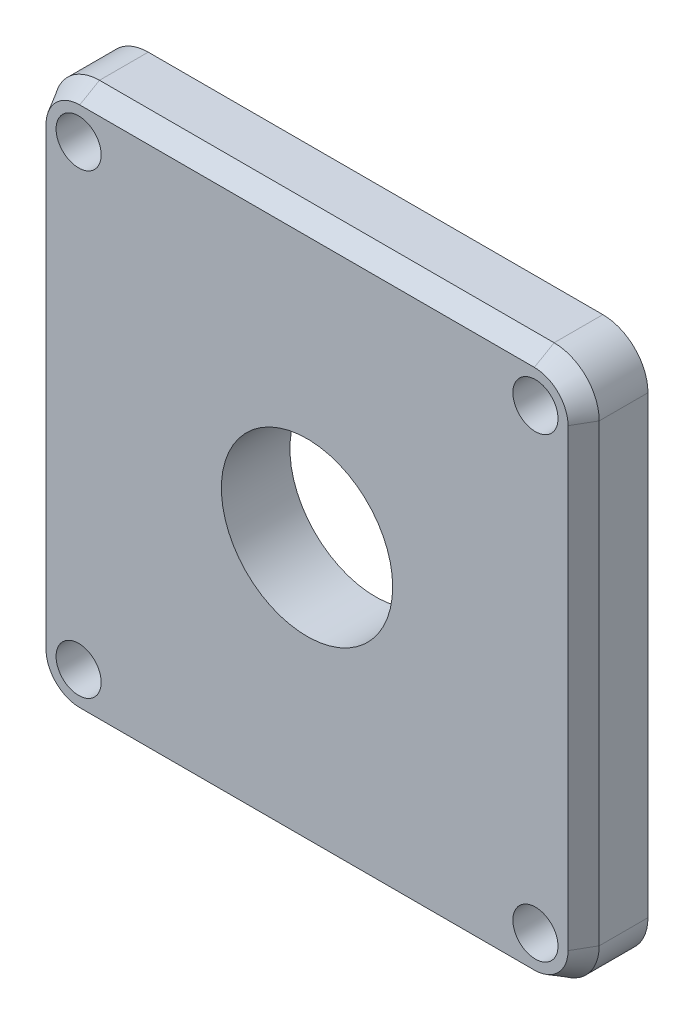
ISO-10303-21;
HEADER;
FILE_DESCRIPTION(('STEP AP214'),'2;1');
FILE_NAME('part.step','',(''),(''),'','','');
FILE_SCHEMA(('AUTOMOTIVE_DESIGN { 1 0 10303 214 1 1 1 1 }'));
ENDSEC;
DATA;
#1=APPLICATION_CONTEXT('core data for automotive mechanical design processes');
#2=APPLICATION_PROTOCOL_DEFINITION('international standard','automotive_design',2000,#1);
#3=PRODUCT_CONTEXT('',#1,'mechanical');
#4=PRODUCT('Part','Part','',(#3));
#5=PRODUCT_RELATED_PRODUCT_CATEGORY('part','',(#4));
#6=PRODUCT_DEFINITION_FORMATION('','',#4);
#7=PRODUCT_DEFINITION_CONTEXT('part definition',#1,'design');
#8=PRODUCT_DEFINITION('design','',#6,#7);
#9=PRODUCT_DEFINITION_SHAPE('','',#8);
#10=(LENGTH_UNIT() NAMED_UNIT(*) SI_UNIT(.MILLI.,.METRE.));
#11=(NAMED_UNIT(*) PLANE_ANGLE_UNIT() SI_UNIT($,.RADIAN.));
#12=(NAMED_UNIT(*) SI_UNIT($,.STERADIAN.) SOLID_ANGLE_UNIT());
#13=UNCERTAINTY_MEASURE_WITH_UNIT(LENGTH_MEASURE(1.E-05),#10,'distance_accuracy_value','');
#14=(GEOMETRIC_REPRESENTATION_CONTEXT(3) GLOBAL_UNCERTAINTY_ASSIGNED_CONTEXT((#13)) GLOBAL_UNIT_ASSIGNED_CONTEXT((#10,
#11,#12)) REPRESENTATION_CONTEXT('',''));
#15=CARTESIAN_POINT('',(0.,0.,0.));
#16=DIRECTION('',(0.,0.,1.));
#17=DIRECTION('',(1.,0.,0.));
#18=AXIS2_PLACEMENT_3D('',#15,#16,#17);
#19=CARTESIAN_POINT('',(0.,-47.7074639149334,2.));
#20=DIRECTION('',(0.,1.,0.));
#21=DIRECTION('',(0.,0.,1.));
#22=AXIS2_PLACEMENT_3D('',#19,#20,#21);
#23=PLANE('',#22);
#24=DIRECTION('',(0.,0.,-1.));
#25=VECTOR('',#24,1.);
#26=CARTESIAN_POINT('',(39.8074639149334,-47.7074639149334,2.));
#27=LINE('',#26,#25);
#28=CARTESIAN_POINT('',(39.8074639149334,-47.7074639149334,0.));
#29=VERTEX_POINT('',#28);
#30=CARTESIAN_POINT('',(39.8074639149334,-47.7074639149334,8.53589838486224));
#31=VERTEX_POINT('',#30);
#32=EDGE_CURVE('E181',#29,#31,#27,.F.);
#33=ORIENTED_EDGE('',*,*,#32,.T.);
#34=DIRECTION('',(-1.,0.,0.));
#35=VECTOR('',#34,1.);
#36=CARTESIAN_POINT('',(0.,-47.7074639149334,8.53589838486224));
#37=LINE('',#36,#35);
#38=CARTESIAN_POINT('',(-39.8074639149334,-47.7074639149334,8.53589838486224));
#39=VERTEX_POINT('',#38);
#40=EDGE_CURVE('E11',#31,#39,#37,.T.);
#41=ORIENTED_EDGE('',*,*,#40,.T.);
#42=DIRECTION('',(0.,0.,-1.));
#43=VECTOR('',#42,1.);
#44=CARTESIAN_POINT('',(-39.8074639149334,-47.7074639149334,0.));
#45=LINE('',#44,#43);
#46=CARTESIAN_POINT('',(-39.8074639149334,-47.7074639149334,0.));
#47=VERTEX_POINT('',#46);
#48=EDGE_CURVE('E179',#39,#47,#45,.T.);
#49=ORIENTED_EDGE('',*,*,#48,.T.);
#50=DIRECTION('',(1.,0.,0.));
#51=VECTOR('',#50,1.);
#52=CARTESIAN_POINT('',(0.,-47.7074639149334,0.));
#53=LINE('',#52,#51);
#54=EDGE_CURVE('E276',#47,#29,#53,.T.);
#55=ORIENTED_EDGE('',*,*,#54,.T.);
#56=EDGE_LOOP('',(#33,#41,#49,#55));
#57=FACE_BOUND('',#56,.T.);
#58=ADVANCED_FACE('F47',(#57),#23,.F.);
#59=CARTESIAN_POINT('',(47.7074639149334,0.,2.));
#60=DIRECTION('',(-1.,0.,0.));
#61=DIRECTION('',(0.,0.,1.));
#62=AXIS2_PLACEMENT_3D('',#59,#60,#61);
#63=PLANE('',#62);
#64=DIRECTION('',(0.,0.,-1.));
#65=VECTOR('',#64,1.);
#66=CARTESIAN_POINT('',(47.7074639149334,39.8074639149334,12.));
#67=LINE('',#66,#65);
#68=CARTESIAN_POINT('',(47.7074639149334,39.8074639149334,0.));
#69=VERTEX_POINT('',#68);
#70=CARTESIAN_POINT('',(47.7074639149334,39.8074639149334,8.53589838486224));
#71=VERTEX_POINT('',#70);
#72=EDGE_CURVE('E176',#69,#71,#67,.F.);
#73=ORIENTED_EDGE('',*,*,#72,.T.);
#74=DIRECTION('',(0.,-1.,0.));
#75=VECTOR('',#74,1.);
#76=CARTESIAN_POINT('',(47.7074639149334,0.,8.53589838486224));
#77=LINE('',#76,#75);
#78=CARTESIAN_POINT('',(47.7074639149334,-39.8074639149334,8.53589838486224));
#79=VERTEX_POINT('',#78);
#80=EDGE_CURVE('E210',#71,#79,#77,.T.);
#81=ORIENTED_EDGE('',*,*,#80,.T.);
#82=DIRECTION('',(0.,0.,-1.));
#83=VECTOR('',#82,1.);
#84=CARTESIAN_POINT('',(47.7074639149334,-39.8074639149334,2.));
#85=LINE('',#84,#83);
#86=CARTESIAN_POINT('',(47.7074639149334,-39.8074639149334,0.));
#87=VERTEX_POINT('',#86);
#88=EDGE_CURVE('E174',#79,#87,#85,.T.);
#89=ORIENTED_EDGE('',*,*,#88,.T.);
#90=DIRECTION('',(0.,1.,0.));
#91=VECTOR('',#90,1.);
#92=CARTESIAN_POINT('',(47.7074639149334,0.,0.));
#93=LINE('',#92,#91);
#94=EDGE_CURVE('E160',#87,#69,#93,.T.);
#95=ORIENTED_EDGE('',*,*,#94,.T.);
#96=EDGE_LOOP('',(#73,#81,#89,#95));
#97=FACE_BOUND('',#96,.T.);
#98=ADVANCED_FACE('F283',(#97),#63,.F.);
#99=CARTESIAN_POINT('',(0.,47.7074639149334,2.));
#100=DIRECTION('',(0.,1.,0.));
#101=DIRECTION('',(0.,0.,1.));
#102=AXIS2_PLACEMENT_3D('',#99,#100,#101);
#103=PLANE('',#102);
#104=DIRECTION('',(0.,0.,-1.));
#105=VECTOR('',#104,1.);
#106=CARTESIAN_POINT('',(-39.8074639149334,47.7074639149334,2.));
#107=LINE('',#106,#105);
#108=CARTESIAN_POINT('',(-39.8074639149334,47.7074639149334,0.));
#109=VERTEX_POINT('',#108);
#110=CARTESIAN_POINT('',(-39.8074639149334,47.7074639149334,8.53589838486224));
#111=VERTEX_POINT('',#110);
#112=EDGE_CURVE('E156',#109,#111,#107,.F.);
#113=ORIENTED_EDGE('',*,*,#112,.T.);
#114=DIRECTION('',(1.,0.,0.));
#115=VECTOR('',#114,1.);
#116=CARTESIAN_POINT('',(39.8074639149334,47.7074639149334,8.53589838486224));
#117=LINE('',#116,#115);
#118=CARTESIAN_POINT('',(39.8074639149334,47.7074639149334,8.53589838486224));
#119=VERTEX_POINT('',#118);
#120=EDGE_CURVE('E188',#111,#119,#117,.T.);
#121=ORIENTED_EDGE('',*,*,#120,.T.);
#122=DIRECTION('',(0.,0.,-1.));
#123=VECTOR('',#122,1.);
#124=CARTESIAN_POINT('',(39.8074639149334,47.7074639149334,0.));
#125=LINE('',#124,#123);
#126=CARTESIAN_POINT('',(39.8074639149334,47.7074639149334,0.));
#127=VERTEX_POINT('',#126);
#128=EDGE_CURVE('E150',#119,#127,#125,.T.);
#129=ORIENTED_EDGE('',*,*,#128,.T.);
#130=DIRECTION('',(1.,0.,0.));
#131=VECTOR('',#130,1.);
#132=CARTESIAN_POINT('',(0.,47.7074639149334,0.));
#133=LINE('',#132,#131);
#134=EDGE_CURVE('E143',#109,#127,#133,.T.);
#135=ORIENTED_EDGE('',*,*,#134,.F.);
#136=EDGE_LOOP('',(#113,#121,#129,#135));
#137=FACE_BOUND('',#136,.T.);
#138=ADVANCED_FACE('F154',(#137),#103,.T.);
#139=CARTESIAN_POINT('',(0.,0.,2.));
#140=DIRECTION('',(0.,0.,-1.));
#141=DIRECTION('',(-1.,0.,0.));
#142=AXIS2_PLACEMENT_3D('',#139,#140,#141);
#143=CYLINDRICAL_SURFACE('',#142,15.);
#144=CARTESIAN_POINT('',(0.,0.,0.));
#145=DIRECTION('',(0.,0.,1.));
#146=DIRECTION('',(1.,0.,0.));
#147=AXIS2_PLACEMENT_3D('',#144,#145,#146);
#148=CIRCLE('',#147,15.);
#149=CARTESIAN_POINT('',(15.,0.,0.));
#150=VERTEX_POINT('',#149);
#151=EDGE_CURVE('E273',#150,#150,#148,.T.);
#152=ORIENTED_EDGE('',*,*,#151,.F.);
#153=EDGE_LOOP('',(#152));
#154=FACE_BOUND('',#153,.T.);
#155=CARTESIAN_POINT('',(0.,0.,12.));
#156=DIRECTION('',(0.,0.,1.));
#157=DIRECTION('',(1.,0.,0.));
#158=AXIS2_PLACEMENT_3D('',#155,#156,#157);
#159=CIRCLE('',#158,15.);
#160=CARTESIAN_POINT('',(15.,0.,12.));
#161=VERTEX_POINT('',#160);
#162=EDGE_CURVE('E268',#161,#161,#159,.T.);
#163=ORIENTED_EDGE('',*,*,#162,.T.);
#164=EDGE_LOOP('',(#163));
#165=FACE_BOUND('',#164,.T.);
#166=ADVANCED_FACE('F328',(#154,#165),#143,.F.);
#167=CARTESIAN_POINT('',(-47.7074639149334,0.,2.));
#168=DIRECTION('',(-1.,0.,0.));
#169=DIRECTION('',(0.,0.,1.));
#170=AXIS2_PLACEMENT_3D('',#167,#168,#169);
#171=PLANE('',#170);
#172=DIRECTION('',(0.,0.,-1.));
#173=VECTOR('',#172,1.);
#174=CARTESIAN_POINT('',(-47.7074639149334,-39.8074639149334,12.));
#175=LINE('',#174,#173);
#176=CARTESIAN_POINT('',(-47.7074639149334,-39.8074639149334,0.));
#177=VERTEX_POINT('',#176);
#178=CARTESIAN_POINT('',(-47.7074639149334,-39.8074639149334,8.53589838486224));
#179=VERTEX_POINT('',#178);
#180=EDGE_CURVE('E185',#177,#179,#175,.F.);
#181=ORIENTED_EDGE('',*,*,#180,.T.);
#182=DIRECTION('',(0.,1.,0.));
#183=VECTOR('',#182,1.);
#184=CARTESIAN_POINT('',(-47.7074639149334,39.8074639149334,8.53589838486224));
#185=LINE('',#184,#183);
#186=CARTESIAN_POINT('',(-47.7074639149334,39.8074639149334,8.53589838486224));
#187=VERTEX_POINT('',#186);
#188=EDGE_CURVE('E212',#179,#187,#185,.T.);
#189=ORIENTED_EDGE('',*,*,#188,.T.);
#190=DIRECTION('',(0.,0.,-1.));
#191=VECTOR('',#190,1.);
#192=CARTESIAN_POINT('',(-47.7074639149334,39.8074639149334,2.));
#193=LINE('',#192,#191);
#194=CARTESIAN_POINT('',(-47.7074639149334,39.8074639149334,0.));
#195=VERTEX_POINT('',#194);
#196=EDGE_CURVE('E183',#187,#195,#193,.T.);
#197=ORIENTED_EDGE('',*,*,#196,.T.);
#198=DIRECTION('',(0.,1.,0.));
#199=VECTOR('',#198,1.);
#200=CARTESIAN_POINT('',(-47.7074639149334,0.,0.));
#201=LINE('',#200,#199);
#202=EDGE_CURVE('E145',#177,#195,#201,.T.);
#203=ORIENTED_EDGE('',*,*,#202,.F.);
#204=EDGE_LOOP('',(#181,#189,#197,#203));
#205=FACE_BOUND('',#204,.T.);
#206=ADVANCED_FACE('F331',(#205),#171,.T.);
#207=CARTESIAN_POINT('',(0.,0.,0.));
#208=DIRECTION('',(0.,0.,1.));
#209=DIRECTION('',(1.,0.,0.));
#210=AXIS2_PLACEMENT_3D('',#207,#208,#209);
#211=PLANE('',#210);
#212=CARTESIAN_POINT('',(-30.,30.,0.));
#213=DIRECTION('',(0.,0.,-1.));
#214=DIRECTION('',(-1.,0.,0.));
#215=AXIS2_PLACEMENT_3D('',#212,#213,#214);
#216=CIRCLE('',#215,3.15);
#217=CARTESIAN_POINT('',(-33.15,30.,0.));
#218=VERTEX_POINT('',#217);
#219=EDGE_CURVE('E739',#218,#218,#216,.T.);
#220=ORIENTED_EDGE('',*,*,#219,.F.);
#221=EDGE_LOOP('',(#220));
#222=FACE_BOUND('',#221,.T.);
#223=CARTESIAN_POINT('',(-30.,-30.,0.));
#224=DIRECTION('',(0.,0.,-1.));
#225=DIRECTION('',(-1.,0.,0.));
#226=AXIS2_PLACEMENT_3D('',#223,#224,#225);
#227=CIRCLE('',#226,3.15);
#228=CARTESIAN_POINT('',(-33.15,-30.,0.));
#229=VERTEX_POINT('',#228);
#230=EDGE_CURVE('E743',#229,#229,#227,.T.);
#231=ORIENTED_EDGE('',*,*,#230,.F.);
#232=EDGE_LOOP('',(#231));
#233=FACE_BOUND('',#232,.T.);
#234=CARTESIAN_POINT('',(30.,-30.,0.));
#235=DIRECTION('',(0.,0.,-1.));
#236=DIRECTION('',(-1.,0.,0.));
#237=AXIS2_PLACEMENT_3D('',#234,#235,#236);
#238=CIRCLE('',#237,3.15);
#239=CARTESIAN_POINT('',(26.85,-30.,0.));
#240=VERTEX_POINT('',#239);
#241=EDGE_CURVE('E747',#240,#240,#238,.T.);
#242=ORIENTED_EDGE('',*,*,#241,.F.);
#243=EDGE_LOOP('',(#242));
#244=FACE_BOUND('',#243,.T.);
#245=CARTESIAN_POINT('',(30.,30.,0.));
#246=DIRECTION('',(0.,0.,-1.));
#247=DIRECTION('',(-1.,0.,0.));
#248=AXIS2_PLACEMENT_3D('',#245,#246,#247);
#249=CIRCLE('',#248,3.15);
#250=CARTESIAN_POINT('',(26.85,30.,0.));
#251=VERTEX_POINT('',#250);
#252=EDGE_CURVE('E751',#251,#251,#249,.T.);
#253=ORIENTED_EDGE('',*,*,#252,.F.);
#254=EDGE_LOOP('',(#253));
#255=FACE_BOUND('',#254,.T.);
#256=ORIENTED_EDGE('',*,*,#151,.T.);
#257=EDGE_LOOP('',(#256));
#258=FACE_BOUND('',#257,.T.);
#259=ORIENTED_EDGE('',*,*,#134,.T.);
#260=CARTESIAN_POINT('',(39.8074639149334,39.8074639149334,0.));
#261=DIRECTION('',(0.,0.,1.));
#262=DIRECTION('',(1.,0.,0.));
#263=AXIS2_PLACEMENT_3D('',#260,#261,#262);
#264=CIRCLE('',#263,7.9);
#265=EDGE_CURVE('E172',#127,#69,#264,.F.);
#266=ORIENTED_EDGE('',*,*,#265,.T.);
#267=ORIENTED_EDGE('',*,*,#94,.F.);
#268=CARTESIAN_POINT('',(39.8074639149334,-39.8074639149334,0.));
#269=DIRECTION('',(0.,0.,1.));
#270=DIRECTION('',(1.,0.,0.));
#271=AXIS2_PLACEMENT_3D('',#268,#269,#270);
#272=CIRCLE('',#271,7.9);
#273=EDGE_CURVE('E170',#87,#29,#272,.F.);
#274=ORIENTED_EDGE('',*,*,#273,.T.);
#275=ORIENTED_EDGE('',*,*,#54,.F.);
#276=CARTESIAN_POINT('',(-39.8074639149334,-39.8074639149334,0.));
#277=DIRECTION('',(0.,0.,1.));
#278=DIRECTION('',(1.,0.,0.));
#279=AXIS2_PLACEMENT_3D('',#276,#277,#278);
#280=CIRCLE('',#279,7.9);
#281=EDGE_CURVE('E149',#47,#177,#280,.F.);
#282=ORIENTED_EDGE('',*,*,#281,.T.);
#283=ORIENTED_EDGE('',*,*,#202,.T.);
#284=CARTESIAN_POINT('',(-39.8074639149334,39.8074639149334,0.));
#285=DIRECTION('',(0.,0.,1.));
#286=DIRECTION('',(1.,0.,0.));
#287=AXIS2_PLACEMENT_3D('',#284,#285,#286);
#288=CIRCLE('',#287,7.9);
#289=EDGE_CURVE('E140',#195,#109,#288,.F.);
#290=ORIENTED_EDGE('',*,*,#289,.T.);
#291=EDGE_LOOP('',(#259,#266,#267,#274,#275,#282,#283,#290));
#292=FACE_BOUND('',#291,.T.);
#293=ADVANCED_FACE('F142',(#222,#233,#244,#255,#258,#292),#211,.F.);
#294=CARTESIAN_POINT('',(0.,0.,12.));
#295=DIRECTION('',(0.,0.,-1.));
#296=DIRECTION('',(-1.,0.,0.));
#297=AXIS2_PLACEMENT_3D('',#294,#295,#296);
#298=PLANE('',#297);
#299=CARTESIAN_POINT('',(39.8074639149334,39.8074639149334,12.));
#300=DIRECTION('',(0.,0.,-1.));
#301=DIRECTION('',(-1.,0.,0.));
#302=AXIS2_PLACEMENT_3D('',#299,#300,#301);
#303=CIRCLE('',#302,5.9);
#304=CARTESIAN_POINT('',(45.7074639149334,39.8074639149334,12.));
#305=VERTEX_POINT('',#304);
#306=CARTESIAN_POINT('',(39.8074639149334,45.7074639149334,12.));
#307=VERTEX_POINT('',#306);
#308=EDGE_CURVE('E202',#305,#307,#303,.F.);
#309=ORIENTED_EDGE('',*,*,#308,.T.);
#310=DIRECTION('',(-1.,0.,0.));
#311=VECTOR('',#310,1.);
#312=CARTESIAN_POINT('',(-39.8074639149334,45.7074639149334,12.));
#313=LINE('',#312,#311);
#314=CARTESIAN_POINT('',(-39.8074639149334,45.7074639149334,12.));
#315=VERTEX_POINT('',#314);
#316=EDGE_CURVE('E204',#307,#315,#313,.T.);
#317=ORIENTED_EDGE('',*,*,#316,.T.);
#318=CARTESIAN_POINT('',(-39.8074639149334,39.8074639149334,12.));
#319=DIRECTION('',(0.,0.,-1.));
#320=DIRECTION('',(-1.,0.,0.));
#321=AXIS2_PLACEMENT_3D('',#318,#319,#320);
#322=CIRCLE('',#321,5.9);
#323=CARTESIAN_POINT('',(-45.7074639149334,39.8074639149334,12.));
#324=VERTEX_POINT('',#323);
#325=EDGE_CURVE('E200',#315,#324,#322,.F.);
#326=ORIENTED_EDGE('',*,*,#325,.T.);
#327=DIRECTION('',(0.,-1.,0.));
#328=VECTOR('',#327,1.);
#329=CARTESIAN_POINT('',(-45.7074639149334,-39.8074639149334,12.));
#330=LINE('',#329,#328);
#331=CARTESIAN_POINT('',(-45.7074639149334,-39.8074639149334,12.));
#332=VERTEX_POINT('',#331);
#333=EDGE_CURVE('E196',#324,#332,#330,.T.);
#334=ORIENTED_EDGE('',*,*,#333,.T.);
#335=CARTESIAN_POINT('',(-39.8074639149334,-39.8074639149334,12.));
#336=DIRECTION('',(0.,0.,-1.));
#337=DIRECTION('',(-1.,0.,0.));
#338=AXIS2_PLACEMENT_3D('',#335,#336,#337);
#339=CIRCLE('',#338,5.9);
#340=CARTESIAN_POINT('',(-39.8074639149334,-45.7074639149334,12.));
#341=VERTEX_POINT('',#340);
#342=EDGE_CURVE('E192',#332,#341,#339,.F.);
#343=ORIENTED_EDGE('',*,*,#342,.T.);
#344=DIRECTION('',(1.,0.,0.));
#345=VECTOR('',#344,1.);
#346=CARTESIAN_POINT('',(0.,-45.7074639149334,12.));
#347=LINE('',#346,#345);
#348=CARTESIAN_POINT('',(39.8074639149334,-45.7074639149334,12.));
#349=VERTEX_POINT('',#348);
#350=EDGE_CURVE('E190',#341,#349,#347,.T.);
#351=ORIENTED_EDGE('',*,*,#350,.T.);
#352=CARTESIAN_POINT('',(39.8074639149334,-39.8074639149334,12.));
#353=DIRECTION('',(0.,0.,-1.));
#354=DIRECTION('',(-1.,0.,0.));
#355=AXIS2_PLACEMENT_3D('',#352,#353,#354);
#356=CIRCLE('',#355,5.9);
#357=CARTESIAN_POINT('',(45.7074639149334,-39.8074639149334,12.));
#358=VERTEX_POINT('',#357);
#359=EDGE_CURVE('E194',#349,#358,#356,.F.);
#360=ORIENTED_EDGE('',*,*,#359,.T.);
#361=DIRECTION('',(0.,1.,0.));
#362=VECTOR('',#361,1.);
#363=CARTESIAN_POINT('',(45.7074639149334,0.,12.));
#364=LINE('',#363,#362);
#365=EDGE_CURVE('E198',#358,#305,#364,.T.);
#366=ORIENTED_EDGE('',*,*,#365,.T.);
#367=EDGE_LOOP('',(#309,#317,#326,#334,#343,#351,#360,#366));
#368=FACE_BOUND('',#367,.T.);
#369=ORIENTED_EDGE('',*,*,#162,.F.);
#370=EDGE_LOOP('',(#369));
#371=FACE_BOUND('',#370,.T.);
#372=CARTESIAN_POINT('',(-40.,40.,12.));
#373=DIRECTION('',(0.,0.,1.));
#374=DIRECTION('',(1.,0.,0.));
#375=AXIS2_PLACEMENT_3D('',#372,#373,#374);
#376=CIRCLE('',#375,3.95);
#377=CARTESIAN_POINT('',(-36.05,40.,12.));
#378=VERTEX_POINT('',#377);
#379=EDGE_CURVE('E265',#378,#378,#376,.T.);
#380=ORIENTED_EDGE('',*,*,#379,.F.);
#381=EDGE_LOOP('',(#380));
#382=FACE_BOUND('',#381,.T.);
#383=CARTESIAN_POINT('',(40.,40.,12.));
#384=DIRECTION('',(0.,0.,1.));
#385=DIRECTION('',(1.,0.,0.));
#386=AXIS2_PLACEMENT_3D('',#383,#384,#385);
#387=CIRCLE('',#386,3.95);
#388=CARTESIAN_POINT('',(43.95,40.,12.));
#389=VERTEX_POINT('',#388);
#390=EDGE_CURVE('E259',#389,#389,#387,.T.);
#391=ORIENTED_EDGE('',*,*,#390,.F.);
#392=EDGE_LOOP('',(#391));
#393=FACE_BOUND('',#392,.T.);
#394=CARTESIAN_POINT('',(40.,-40.,12.));
#395=DIRECTION('',(0.,0.,1.));
#396=DIRECTION('',(1.,0.,0.));
#397=AXIS2_PLACEMENT_3D('',#394,#395,#396);
#398=CIRCLE('',#397,3.95);
#399=CARTESIAN_POINT('',(43.95,-40.,12.));
#400=VERTEX_POINT('',#399);
#401=EDGE_CURVE('E253',#400,#400,#398,.T.);
#402=ORIENTED_EDGE('',*,*,#401,.F.);
#403=EDGE_LOOP('',(#402));
#404=FACE_BOUND('',#403,.T.);
#405=CARTESIAN_POINT('',(-40.,-40.,12.));
#406=DIRECTION('',(0.,0.,1.));
#407=DIRECTION('',(1.,0.,0.));
#408=AXIS2_PLACEMENT_3D('',#405,#406,#407);
#409=CIRCLE('',#408,3.95);
#410=CARTESIAN_POINT('',(-36.05,-40.,12.));
#411=VERTEX_POINT('',#410);
#412=EDGE_CURVE('E244',#411,#411,#409,.T.);
#413=ORIENTED_EDGE('',*,*,#412,.F.);
#414=EDGE_LOOP('',(#413));
#415=FACE_BOUND('',#414,.T.);
#416=ADVANCED_FACE('F300',(#368,#371,#382,#393,#404,#415),#298,.F.);
#417=CARTESIAN_POINT('',(-40.,40.,12.));
#418=DIRECTION('',(0.,0.,-1.));
#419=DIRECTION('',(-1.,0.,0.));
#420=AXIS2_PLACEMENT_3D('',#417,#418,#419);
#421=CYLINDRICAL_SURFACE('',#420,3.95);
#422=ORIENTED_EDGE('',*,*,#379,.T.);
#423=EDGE_LOOP('',(#422));
#424=FACE_BOUND('',#423,.T.);
#425=CARTESIAN_POINT('',(-40.,40.,2.));
#426=DIRECTION('',(0.,0.,1.));
#427=DIRECTION('',(1.,0.,0.));
#428=AXIS2_PLACEMENT_3D('',#425,#426,#427);
#429=CIRCLE('',#428,3.95);
#430=CARTESIAN_POINT('',(-36.05,40.,2.));
#431=VERTEX_POINT('',#430);
#432=EDGE_CURVE('E262',#431,#431,#429,.T.);
#433=ORIENTED_EDGE('',*,*,#432,.F.);
#434=EDGE_LOOP('',(#433));
#435=FACE_BOUND('',#434,.T.);
#436=ADVANCED_FACE('F595',(#424,#435),#421,.F.);
#437=CARTESIAN_POINT('',(40.,40.,12.));
#438=DIRECTION('',(0.,0.,-1.));
#439=DIRECTION('',(-1.,0.,0.));
#440=AXIS2_PLACEMENT_3D('',#437,#438,#439);
#441=CYLINDRICAL_SURFACE('',#440,3.95);
#442=ORIENTED_EDGE('',*,*,#390,.T.);
#443=EDGE_LOOP('',(#442));
#444=FACE_BOUND('',#443,.T.);
#445=CARTESIAN_POINT('',(40.,40.,2.));
#446=DIRECTION('',(0.,0.,1.));
#447=DIRECTION('',(1.,0.,0.));
#448=AXIS2_PLACEMENT_3D('',#445,#446,#447);
#449=CIRCLE('',#448,3.95);
#450=CARTESIAN_POINT('',(43.95,40.,2.));
#451=VERTEX_POINT('',#450);
#452=EDGE_CURVE('E256',#451,#451,#449,.T.);
#453=ORIENTED_EDGE('',*,*,#452,.F.);
#454=EDGE_LOOP('',(#453));
#455=FACE_BOUND('',#454,.T.);
#456=ADVANCED_FACE('F584',(#444,#455),#441,.F.);
#457=CARTESIAN_POINT('',(40.,-40.,12.));
#458=DIRECTION('',(0.,0.,-1.));
#459=DIRECTION('',(-1.,0.,0.));
#460=AXIS2_PLACEMENT_3D('',#457,#458,#459);
#461=CYLINDRICAL_SURFACE('',#460,3.95);
#462=ORIENTED_EDGE('',*,*,#401,.T.);
#463=EDGE_LOOP('',(#462));
#464=FACE_BOUND('',#463,.T.);
#465=CARTESIAN_POINT('',(40.,-40.,2.));
#466=DIRECTION('',(0.,0.,1.));
#467=DIRECTION('',(1.,0.,0.));
#468=AXIS2_PLACEMENT_3D('',#465,#466,#467);
#469=CIRCLE('',#468,3.95);
#470=CARTESIAN_POINT('',(43.95,-40.,2.));
#471=VERTEX_POINT('',#470);
#472=EDGE_CURVE('E249',#471,#471,#469,.T.);
#473=ORIENTED_EDGE('',*,*,#472,.F.);
#474=EDGE_LOOP('',(#473));
#475=FACE_BOUND('',#474,.T.);
#476=ADVANCED_FACE('F572',(#464,#475),#461,.F.);
#477=CARTESIAN_POINT('',(-40.,-40.,12.));
#478=DIRECTION('',(0.,0.,-1.));
#479=DIRECTION('',(-1.,0.,0.));
#480=AXIS2_PLACEMENT_3D('',#477,#478,#479);
#481=CYLINDRICAL_SURFACE('',#480,3.95);
#482=ORIENTED_EDGE('',*,*,#412,.T.);
#483=EDGE_LOOP('',(#482));
#484=FACE_BOUND('',#483,.T.);
#485=CARTESIAN_POINT('',(-40.,-40.,2.));
#486=DIRECTION('',(0.,0.,1.));
#487=DIRECTION('',(1.,0.,0.));
#488=AXIS2_PLACEMENT_3D('',#485,#486,#487);
#489=CIRCLE('',#488,3.95);
#490=CARTESIAN_POINT('',(-36.05,-40.,2.));
#491=VERTEX_POINT('',#490);
#492=EDGE_CURVE('E238',#491,#491,#489,.T.);
#493=ORIENTED_EDGE('',*,*,#492,.F.);
#494=EDGE_LOOP('',(#493));
#495=FACE_BOUND('',#494,.T.);
#496=ADVANCED_FACE('F565',(#484,#495),#481,.F.);
#497=CARTESIAN_POINT('',(0.,0.,2.));
#498=DIRECTION('',(0.,0.,1.));
#499=DIRECTION('',(1.,0.,0.));
#500=AXIS2_PLACEMENT_3D('',#497,#498,#499);
#501=PLANE('',#500);
#502=ORIENTED_EDGE('',*,*,#452,.T.);
#503=EDGE_LOOP('',(#502));
#504=FACE_BOUND('',#503,.T.);
#505=ADVANCED_FACE('F571',(#504),#501,.T.);
#506=ORIENTED_EDGE('',*,*,#432,.T.);
#507=EDGE_LOOP('',(#506));
#508=FACE_BOUND('',#507,.T.);
#509=ADVANCED_FACE('F674',(#508),#501,.T.);
#510=ORIENTED_EDGE('',*,*,#472,.T.);
#511=EDGE_LOOP('',(#510));
#512=FACE_BOUND('',#511,.T.);
#513=ADVANCED_FACE('F669',(#512),#501,.T.);
#514=ORIENTED_EDGE('',*,*,#492,.T.);
#515=EDGE_LOOP('',(#514));
#516=FACE_BOUND('',#515,.T.);
#517=ADVANCED_FACE('F335',(#516),#501,.T.);
#518=CARTESIAN_POINT('',(39.8074639149334,39.8074639149334,2.));
#519=DIRECTION('',(0.,0.,1.));
#520=DIRECTION('',(1.,0.,0.));
#521=AXIS2_PLACEMENT_3D('',#518,#519,#520);
#522=CYLINDRICAL_SURFACE('',#521,7.9);
#523=ORIENTED_EDGE('',*,*,#128,.F.);
#524=CARTESIAN_POINT('',(39.8074639149334,39.8074639149334,8.53589838486224));
#525=DIRECTION('',(0.,0.,-1.));
#526=DIRECTION('',(-1.,0.,0.));
#527=AXIS2_PLACEMENT_3D('',#524,#525,#526);
#528=CIRCLE('',#527,7.9);
#529=EDGE_CURVE('E207',#119,#71,#528,.T.);
#530=ORIENTED_EDGE('',*,*,#529,.T.);
#531=ORIENTED_EDGE('',*,*,#72,.F.);
#532=ORIENTED_EDGE('',*,*,#265,.F.);
#533=EDGE_LOOP('',(#523,#530,#531,#532));
#534=FACE_BOUND('',#533,.T.);
#535=ADVANCED_FACE('F287',(#534),#522,.T.);
#536=CARTESIAN_POINT('',(39.8074639149334,-39.8074639149334,2.));
#537=DIRECTION('',(0.,0.,-1.));
#538=DIRECTION('',(-1.,0.,0.));
#539=AXIS2_PLACEMENT_3D('',#536,#537,#538);
#540=CYLINDRICAL_SURFACE('',#539,7.9);
#541=ORIENTED_EDGE('',*,*,#88,.F.);
#542=CARTESIAN_POINT('',(39.8074639149334,-39.8074639149334,8.53589838486224));
#543=DIRECTION('',(0.,0.,-1.));
#544=DIRECTION('',(-1.,0.,0.));
#545=AXIS2_PLACEMENT_3D('',#542,#543,#544);
#546=CIRCLE('',#545,7.9);
#547=EDGE_CURVE('E71',#79,#31,#546,.T.);
#548=ORIENTED_EDGE('',*,*,#547,.T.);
#549=ORIENTED_EDGE('',*,*,#32,.F.);
#550=ORIENTED_EDGE('',*,*,#273,.F.);
#551=EDGE_LOOP('',(#541,#548,#549,#550));
#552=FACE_BOUND('',#551,.T.);
#553=ADVANCED_FACE('F307',(#552),#540,.T.);
#554=CARTESIAN_POINT('',(-39.8074639149334,-39.8074639149334,2.));
#555=DIRECTION('',(0.,0.,1.));
#556=DIRECTION('',(1.,0.,0.));
#557=AXIS2_PLACEMENT_3D('',#554,#555,#556);
#558=CYLINDRICAL_SURFACE('',#557,7.9);
#559=ORIENTED_EDGE('',*,*,#48,.F.);
#560=CARTESIAN_POINT('',(-39.8074639149334,-39.8074639149334,8.53589838486224));
#561=DIRECTION('',(0.,0.,-1.));
#562=DIRECTION('',(-1.,0.,0.));
#563=AXIS2_PLACEMENT_3D('',#560,#561,#562);
#564=CIRCLE('',#563,7.9);
#565=EDGE_CURVE('E57',#39,#179,#564,.T.);
#566=ORIENTED_EDGE('',*,*,#565,.T.);
#567=ORIENTED_EDGE('',*,*,#180,.F.);
#568=ORIENTED_EDGE('',*,*,#281,.F.);
#569=EDGE_LOOP('',(#559,#566,#567,#568));
#570=FACE_BOUND('',#569,.T.);
#571=ADVANCED_FACE('F338',(#570),#558,.T.);
#572=CARTESIAN_POINT('',(-39.8074639149334,39.8074639149334,2.));
#573=DIRECTION('',(0.,0.,-1.));
#574=DIRECTION('',(-1.,0.,0.));
#575=AXIS2_PLACEMENT_3D('',#572,#573,#574);
#576=CYLINDRICAL_SURFACE('',#575,7.9);
#577=ORIENTED_EDGE('',*,*,#196,.F.);
#578=CARTESIAN_POINT('',(-39.8074639149334,39.8074639149334,8.53589838486224));
#579=DIRECTION('',(0.,0.,-1.));
#580=DIRECTION('',(-1.,0.,0.));
#581=AXIS2_PLACEMENT_3D('',#578,#579,#580);
#582=CIRCLE('',#581,7.9);
#583=EDGE_CURVE('E164',#187,#111,#582,.T.);
#584=ORIENTED_EDGE('',*,*,#583,.T.);
#585=ORIENTED_EDGE('',*,*,#112,.F.);
#586=ORIENTED_EDGE('',*,*,#289,.F.);
#587=EDGE_LOOP('',(#577,#584,#585,#586));
#588=FACE_BOUND('',#587,.T.);
#589=ADVANCED_FACE('F162',(#588),#576,.T.);
#590=CARTESIAN_POINT('',(0.,-47.7074639149334,8.53589838486224));
#591=DIRECTION('',(0.,0.866025403784439,-0.5));
#592=DIRECTION('',(-1.,0.,0.));
#593=AXIS2_PLACEMENT_3D('',#590,#591,#592);
#594=PLANE('',#593);
#595=DIRECTION('',(0.,-0.5,-0.866025403784439));
#596=VECTOR('',#595,1.);
#597=CARTESIAN_POINT('',(39.8074639149334,-45.7074639149334,12.));
#598=LINE('',#597,#596);
#599=EDGE_CURVE('E232',#349,#31,#598,.T.);
#600=ORIENTED_EDGE('',*,*,#599,.F.);
#601=ORIENTED_EDGE('',*,*,#350,.F.);
#602=DIRECTION('',(0.,0.5,0.866025403784439));
#603=VECTOR('',#602,1.);
#604=CARTESIAN_POINT('',(-39.8074639149334,-47.7074639149334,8.53589838486224));
#605=LINE('',#604,#603);
#606=EDGE_CURVE('E52',#39,#341,#605,.T.);
#607=ORIENTED_EDGE('',*,*,#606,.F.);
#608=ORIENTED_EDGE('',*,*,#40,.F.);
#609=EDGE_LOOP('',(#600,#601,#607,#608));
#610=FACE_BOUND('',#609,.T.);
#611=ADVANCED_FACE('F50',(#610),#594,.F.);
#612=CARTESIAN_POINT('',(-39.8074639149334,-39.8074639149334,12.));
#613=DIRECTION('',(0.,0.,-1.));
#614=DIRECTION('',(-1.,0.,0.));
#615=AXIS2_PLACEMENT_3D('',#612,#613,#614);
#616=CONICAL_SURFACE('',#615,5.9,0.5235987755983);
#617=ORIENTED_EDGE('',*,*,#606,.T.);
#618=ORIENTED_EDGE('',*,*,#342,.F.);
#619=DIRECTION('',(0.500000000000001,0.,0.866025403784438));
#620=VECTOR('',#619,1.);
#621=CARTESIAN_POINT('',(-47.7074639149334,-39.8074639149334,8.53589838486224));
#622=LINE('',#621,#620);
#623=EDGE_CURVE('E230',#179,#332,#622,.T.);
#624=ORIENTED_EDGE('',*,*,#623,.F.);
#625=ORIENTED_EDGE('',*,*,#565,.F.);
#626=EDGE_LOOP('',(#617,#618,#624,#625));
#627=FACE_BOUND('',#626,.T.);
#628=ADVANCED_FACE('F311',(#627),#616,.T.);
#629=CARTESIAN_POINT('',(39.8074639149334,-39.8074639149334,12.));
#630=DIRECTION('',(0.,0.,-1.));
#631=DIRECTION('',(-1.,0.,0.));
#632=AXIS2_PLACEMENT_3D('',#629,#630,#631);
#633=CONICAL_SURFACE('',#632,5.9,0.523598775598298);
#634=ORIENTED_EDGE('',*,*,#599,.T.);
#635=ORIENTED_EDGE('',*,*,#547,.F.);
#636=DIRECTION('',(0.5,0.,-0.866025403784439));
#637=VECTOR('',#636,1.);
#638=CARTESIAN_POINT('',(45.7074639149334,-39.8074639149334,12.));
#639=LINE('',#638,#637);
#640=EDGE_CURVE('E227',#358,#79,#639,.T.);
#641=ORIENTED_EDGE('',*,*,#640,.F.);
#642=ORIENTED_EDGE('',*,*,#359,.F.);
#643=EDGE_LOOP('',(#634,#635,#641,#642));
#644=FACE_BOUND('',#643,.T.);
#645=ADVANCED_FACE('F308',(#644),#633,.T.);
#646=CARTESIAN_POINT('',(-47.7074639149334,0.,8.53589838486224));
#647=DIRECTION('',(-0.866025403784439,0.,0.5));
#648=DIRECTION('',(0.,-1.,0.));
#649=AXIS2_PLACEMENT_3D('',#646,#647,#648);
#650=PLANE('',#649);
#651=ORIENTED_EDGE('',*,*,#623,.T.);
#652=ORIENTED_EDGE('',*,*,#333,.F.);
#653=DIRECTION('',(0.5,0.,0.866025403784439));
#654=VECTOR('',#653,1.);
#655=CARTESIAN_POINT('',(-47.7074639149334,39.8074639149334,8.53589838486224));
#656=LINE('',#655,#654);
#657=EDGE_CURVE('E224',#187,#324,#656,.T.);
#658=ORIENTED_EDGE('',*,*,#657,.F.);
#659=ORIENTED_EDGE('',*,*,#188,.F.);
#660=EDGE_LOOP('',(#651,#652,#658,#659));
#661=FACE_BOUND('',#660,.T.);
#662=ADVANCED_FACE('F310',(#661),#650,.T.);
#663=CARTESIAN_POINT('',(47.7074639149334,0.,8.53589838486224));
#664=DIRECTION('',(-0.866025403784439,0.,-0.5));
#665=DIRECTION('',(0.,-1.,0.));
#666=AXIS2_PLACEMENT_3D('',#663,#664,#665);
#667=PLANE('',#666);
#668=ORIENTED_EDGE('',*,*,#640,.T.);
#669=ORIENTED_EDGE('',*,*,#80,.F.);
#670=DIRECTION('',(0.5,0.,-0.866025403784439));
#671=VECTOR('',#670,1.);
#672=CARTESIAN_POINT('',(45.7074639149334,39.8074639149334,12.));
#673=LINE('',#672,#671);
#674=EDGE_CURVE('E221',#305,#71,#673,.T.);
#675=ORIENTED_EDGE('',*,*,#674,.F.);
#676=ORIENTED_EDGE('',*,*,#365,.F.);
#677=EDGE_LOOP('',(#668,#669,#675,#676));
#678=FACE_BOUND('',#677,.T.);
#679=ADVANCED_FACE('F306',(#678),#667,.F.);
#680=CARTESIAN_POINT('',(-39.8074639149334,39.8074639149334,12.));
#681=DIRECTION('',(0.,0.,-1.));
#682=DIRECTION('',(-1.,0.,0.));
#683=AXIS2_PLACEMENT_3D('',#680,#681,#682);
#684=CONICAL_SURFACE('',#683,5.9,0.523598775598298);
#685=ORIENTED_EDGE('',*,*,#657,.T.);
#686=ORIENTED_EDGE('',*,*,#325,.F.);
#687=DIRECTION('',(0.,-0.499999999999999,0.866025403784439));
#688=VECTOR('',#687,1.);
#689=CARTESIAN_POINT('',(-39.8074639149334,47.7074639149334,8.53589838486224));
#690=LINE('',#689,#688);
#691=EDGE_CURVE('E218',#111,#315,#690,.T.);
#692=ORIENTED_EDGE('',*,*,#691,.F.);
#693=ORIENTED_EDGE('',*,*,#583,.F.);
#694=EDGE_LOOP('',(#685,#686,#692,#693));
#695=FACE_BOUND('',#694,.T.);
#696=ADVANCED_FACE('F356',(#695),#684,.T.);
#697=CARTESIAN_POINT('',(39.8074639149334,39.8074639149334,12.));
#698=DIRECTION('',(0.,0.,-1.));
#699=DIRECTION('',(-1.,0.,0.));
#700=AXIS2_PLACEMENT_3D('',#697,#698,#699);
#701=CONICAL_SURFACE('',#700,5.9,0.5235987755983);
#702=ORIENTED_EDGE('',*,*,#674,.T.);
#703=ORIENTED_EDGE('',*,*,#529,.F.);
#704=DIRECTION('',(0.,0.5,-0.866025403784439));
#705=VECTOR('',#704,1.);
#706=CARTESIAN_POINT('',(39.8074639149334,45.7074639149334,12.));
#707=LINE('',#706,#705);
#708=EDGE_CURVE('E216',#307,#119,#707,.T.);
#709=ORIENTED_EDGE('',*,*,#708,.F.);
#710=ORIENTED_EDGE('',*,*,#308,.F.);
#711=EDGE_LOOP('',(#702,#703,#709,#710));
#712=FACE_BOUND('',#711,.T.);
#713=ADVANCED_FACE('F291',(#712),#701,.T.);
#714=CARTESIAN_POINT('',(0.,47.7074639149334,8.53589838486224));
#715=DIRECTION('',(0.,0.866025403784439,0.5));
#716=DIRECTION('',(-1.,0.,0.));
#717=AXIS2_PLACEMENT_3D('',#714,#715,#716);
#718=PLANE('',#717);
#719=ORIENTED_EDGE('',*,*,#691,.T.);
#720=ORIENTED_EDGE('',*,*,#316,.F.);
#721=ORIENTED_EDGE('',*,*,#708,.T.);
#722=ORIENTED_EDGE('',*,*,#120,.F.);
#723=EDGE_LOOP('',(#719,#720,#721,#722));
#724=FACE_BOUND('',#723,.T.);
#725=ADVANCED_FACE('F296',(#724),#718,.T.);
#726=CARTESIAN_POINT('',(30.,30.,8.));
#727=DIRECTION('',(0.,0.,-1.));
#728=DIRECTION('',(-1.,0.,0.));
#729=AXIS2_PLACEMENT_3D('',#726,#727,#728);
#730=CYLINDRICAL_SURFACE('',#729,3.15);
#731=CARTESIAN_POINT('',(30.,30.,8.));
#732=DIRECTION('',(0.,0.,-1.));
#733=DIRECTION('',(-1.,0.,0.));
#734=AXIS2_PLACEMENT_3D('',#731,#732,#733);
#735=CIRCLE('',#734,3.15);
#736=CARTESIAN_POINT('',(26.85,30.,8.));
#737=VERTEX_POINT('',#736);
#738=EDGE_CURVE('E219',#737,#737,#735,.T.);
#739=ORIENTED_EDGE('',*,*,#738,.F.);
#740=EDGE_LOOP('',(#739));
#741=FACE_BOUND('',#740,.T.);
#742=ORIENTED_EDGE('',*,*,#252,.T.);
#743=EDGE_LOOP('',(#742));
#744=FACE_BOUND('',#743,.T.);
#745=ADVANCED_FACE('F350',(#741,#744),#730,.F.);
#746=CARTESIAN_POINT('',(30.,30.,8.));
#747=DIRECTION('',(0.,0.,-1.));
#748=DIRECTION('',(-1.,0.,0.));
#749=AXIS2_PLACEMENT_3D('',#746,#747,#748);
#750=PLANE('',#749);
#751=ORIENTED_EDGE('',*,*,#738,.T.);
#752=EDGE_LOOP('',(#751));
#753=FACE_BOUND('',#752,.T.);
#754=ADVANCED_FACE('F399',(#753),#750,.T.);
#755=CARTESIAN_POINT('',(30.,-30.,8.));
#756=DIRECTION('',(0.,0.,-1.));
#757=DIRECTION('',(-1.,0.,0.));
#758=AXIS2_PLACEMENT_3D('',#755,#756,#757);
#759=CYLINDRICAL_SURFACE('',#758,3.15);
#760=CARTESIAN_POINT('',(30.,-30.,8.));
#761=DIRECTION('',(0.,0.,-1.));
#762=DIRECTION('',(-1.,0.,0.));
#763=AXIS2_PLACEMENT_3D('',#760,#761,#762);
#764=CIRCLE('',#763,3.15);
#765=CARTESIAN_POINT('',(26.85,-30.,8.));
#766=VERTEX_POINT('',#765);
#767=EDGE_CURVE('E773',#766,#766,#764,.T.);
#768=ORIENTED_EDGE('',*,*,#767,.F.);
#769=EDGE_LOOP('',(#768));
#770=FACE_BOUND('',#769,.T.);
#771=ORIENTED_EDGE('',*,*,#241,.T.);
#772=EDGE_LOOP('',(#771));
#773=FACE_BOUND('',#772,.T.);
#774=ADVANCED_FACE('F407',(#770,#773),#759,.F.);
#775=CARTESIAN_POINT('',(30.,-30.,8.));
#776=DIRECTION('',(0.,0.,-1.));
#777=DIRECTION('',(-1.,0.,0.));
#778=AXIS2_PLACEMENT_3D('',#775,#776,#777);
#779=PLANE('',#778);
#780=ORIENTED_EDGE('',*,*,#767,.T.);
#781=EDGE_LOOP('',(#780));
#782=FACE_BOUND('',#781,.T.);
#783=ADVANCED_FACE('F415',(#782),#779,.T.);
#784=CARTESIAN_POINT('',(-30.,-30.,8.));
#785=DIRECTION('',(0.,0.,-1.));
#786=DIRECTION('',(-1.,0.,0.));
#787=AXIS2_PLACEMENT_3D('',#784,#785,#786);
#788=CYLINDRICAL_SURFACE('',#787,3.15);
#789=CARTESIAN_POINT('',(-30.,-30.,8.));
#790=DIRECTION('',(0.,0.,-1.));
#791=DIRECTION('',(-1.,0.,0.));
#792=AXIS2_PLACEMENT_3D('',#789,#790,#791);
#793=CIRCLE('',#792,3.15);
#794=CARTESIAN_POINT('',(-33.15,-30.,8.));
#795=VERTEX_POINT('',#794);
#796=EDGE_CURVE('E780',#795,#795,#793,.T.);
#797=ORIENTED_EDGE('',*,*,#796,.F.);
#798=EDGE_LOOP('',(#797));
#799=FACE_BOUND('',#798,.T.);
#800=ORIENTED_EDGE('',*,*,#230,.T.);
#801=EDGE_LOOP('',(#800));
#802=FACE_BOUND('',#801,.T.);
#803=ADVANCED_FACE('F423',(#799,#802),#788,.F.);
#804=CARTESIAN_POINT('',(-30.,-30.,8.));
#805=DIRECTION('',(0.,0.,-1.));
#806=DIRECTION('',(-1.,0.,0.));
#807=AXIS2_PLACEMENT_3D('',#804,#805,#806);
#808=PLANE('',#807);
#809=ORIENTED_EDGE('',*,*,#796,.T.);
#810=EDGE_LOOP('',(#809));
#811=FACE_BOUND('',#810,.T.);
#812=ADVANCED_FACE('F431',(#811),#808,.T.);
#813=CARTESIAN_POINT('',(-30.,30.,8.));
#814=DIRECTION('',(0.,0.,-1.));
#815=DIRECTION('',(-1.,0.,0.));
#816=AXIS2_PLACEMENT_3D('',#813,#814,#815);
#817=CYLINDRICAL_SURFACE('',#816,3.15);
#818=CARTESIAN_POINT('',(-30.,30.,8.));
#819=DIRECTION('',(0.,0.,-1.));
#820=DIRECTION('',(-1.,0.,0.));
#821=AXIS2_PLACEMENT_3D('',#818,#819,#820);
#822=CIRCLE('',#821,3.15);
#823=CARTESIAN_POINT('',(-33.15,30.,8.));
#824=VERTEX_POINT('',#823);
#825=EDGE_CURVE('E776',#824,#824,#822,.T.);
#826=ORIENTED_EDGE('',*,*,#825,.F.);
#827=EDGE_LOOP('',(#826));
#828=FACE_BOUND('',#827,.T.);
#829=ORIENTED_EDGE('',*,*,#219,.T.);
#830=EDGE_LOOP('',(#829));
#831=FACE_BOUND('',#830,.T.);
#832=ADVANCED_FACE('F439',(#828,#831),#817,.F.);
#833=CARTESIAN_POINT('',(-30.,30.,8.));
#834=DIRECTION('',(0.,0.,-1.));
#835=DIRECTION('',(-1.,0.,0.));
#836=AXIS2_PLACEMENT_3D('',#833,#834,#835);
#837=PLANE('',#836);
#838=ORIENTED_EDGE('',*,*,#825,.T.);
#839=EDGE_LOOP('',(#838));
#840=FACE_BOUND('',#839,.T.);
#841=ADVANCED_FACE('F447',(#840),#837,.T.);
#842=CLOSED_SHELL('',(#58,#98,#138,#166,#206,#293,#416,#436,#456,#476,#496,#505,#509,#513,#517,
#535,#553,#571,#589,#611,#628,#645,#662,#679,#696,#713,#725,#745,#754,#774,#783,#803,#812,#832,#841));
#843=MANIFOLD_SOLID_BREP('B2',#842);
#844=ADVANCED_BREP_SHAPE_REPRESENTATION('',(#18,#843),#14);
#845=SHAPE_DEFINITION_REPRESENTATION(#9,#844);
ENDSEC;
END-ISO-10303-21;
